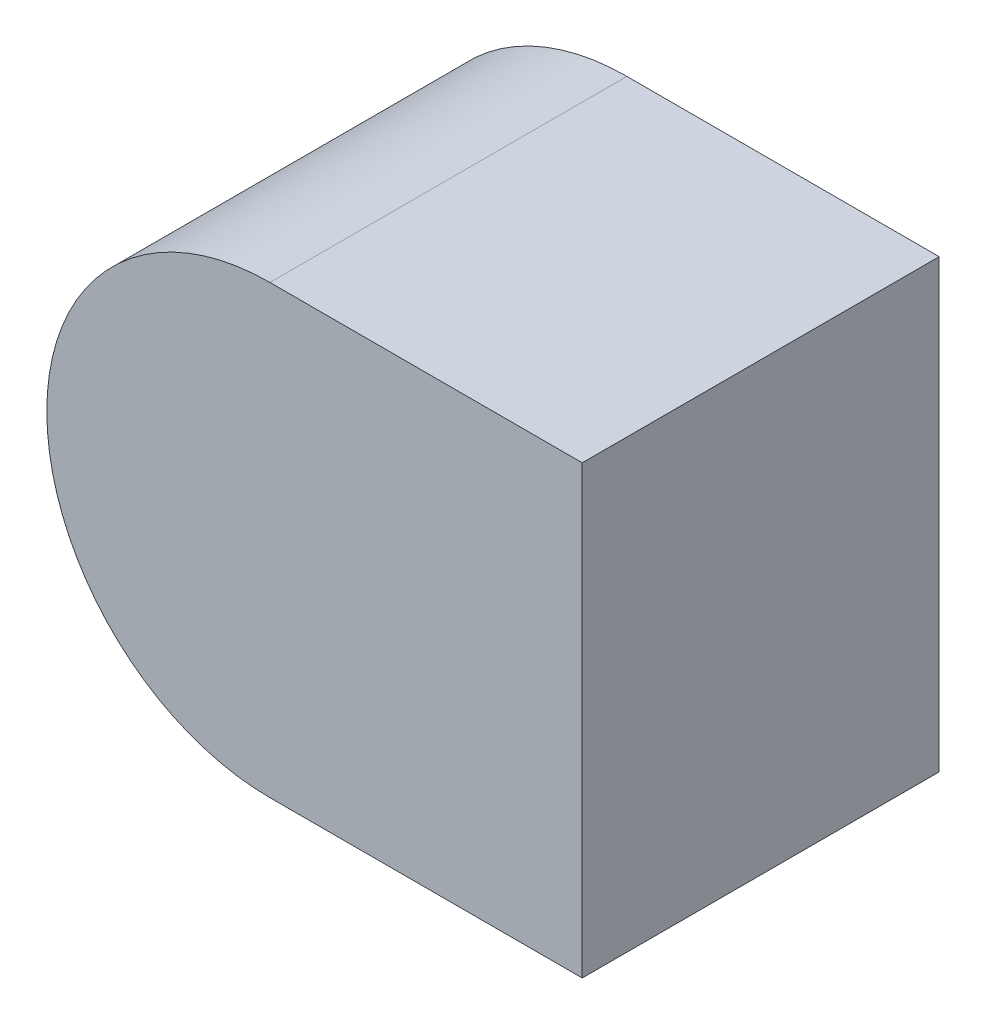
ISO-10303-21;
HEADER;
FILE_DESCRIPTION(('STEP AP214'),'2;1');
FILE_NAME('part.step','',(''),(''),'','','');
FILE_SCHEMA(('AUTOMOTIVE_DESIGN { 1 0 10303 214 1 1 1 1 }'));
ENDSEC;
DATA;
#1=APPLICATION_CONTEXT('core data for automotive mechanical design processes');
#2=APPLICATION_PROTOCOL_DEFINITION('international standard','automotive_design',2000,#1);
#3=PRODUCT_CONTEXT('',#1,'mechanical');
#4=PRODUCT('Part','Part','',(#3));
#5=PRODUCT_RELATED_PRODUCT_CATEGORY('part','',(#4));
#6=PRODUCT_DEFINITION_FORMATION('','',#4);
#7=PRODUCT_DEFINITION_CONTEXT('part definition',#1,'design');
#8=PRODUCT_DEFINITION('design','',#6,#7);
#9=PRODUCT_DEFINITION_SHAPE('','',#8);
#10=(LENGTH_UNIT() NAMED_UNIT(*) SI_UNIT(.MILLI.,.METRE.));
#11=(NAMED_UNIT(*) PLANE_ANGLE_UNIT() SI_UNIT($,.RADIAN.));
#12=(NAMED_UNIT(*) SI_UNIT($,.STERADIAN.) SOLID_ANGLE_UNIT());
#13=UNCERTAINTY_MEASURE_WITH_UNIT(LENGTH_MEASURE(1.E-05),#10,'distance_accuracy_value','');
#14=(GEOMETRIC_REPRESENTATION_CONTEXT(3) GLOBAL_UNCERTAINTY_ASSIGNED_CONTEXT((#13)) GLOBAL_UNIT_ASSIGNED_CONTEXT((#10,
#11,#12)) REPRESENTATION_CONTEXT('',''));
#15=CARTESIAN_POINT('',(0.,0.,0.));
#16=DIRECTION('',(0.,0.,1.));
#17=DIRECTION('',(1.,0.,0.));
#18=AXIS2_PLACEMENT_3D('',#15,#16,#17);
#19=CARTESIAN_POINT('',(0.703,0.375,0.));
#20=DIRECTION('',(0.,-1.,0.));
#21=DIRECTION('',(1.,0.,0.));
#22=AXIS2_PLACEMENT_3D('',#19,#20,#21);
#23=PLANE('',#22);
#24=DIRECTION('',(0.,0.,1.));
#25=VECTOR('',#24,1.);
#26=CARTESIAN_POINT('',(0.828,0.375,0.));
#27=LINE('',#26,#25);
#28=CARTESIAN_POINT('',(0.828,0.375,0.));
#29=VERTEX_POINT('',#28);
#30=CARTESIAN_POINT('',(0.828,0.375,0.2));
#31=VERTEX_POINT('',#30);
#32=EDGE_CURVE('E11',#29,#31,#27,.T.);
#33=ORIENTED_EDGE('',*,*,#32,.T.);
#34=DIRECTION('',(1.,0.,0.));
#35=VECTOR('',#34,1.);
#36=CARTESIAN_POINT('',(0.703,0.375,0.2));
#37=LINE('',#36,#35);
#38=CARTESIAN_POINT('',(1.003,0.375,0.2));
#39=VERTEX_POINT('',#38);
#40=EDGE_CURVE('E24',#31,#39,#37,.T.);
#41=ORIENTED_EDGE('',*,*,#40,.T.);
#42=DIRECTION('',(0.,0.,1.));
#43=VECTOR('',#42,1.);
#44=CARTESIAN_POINT('',(1.003,0.375,0.));
#45=LINE('',#44,#43);
#46=CARTESIAN_POINT('',(1.003,0.375,0.));
#47=VERTEX_POINT('',#46);
#48=EDGE_CURVE('E75',#47,#39,#45,.T.);
#49=ORIENTED_EDGE('',*,*,#48,.F.);
#50=DIRECTION('',(1.,0.,0.));
#51=VECTOR('',#50,1.);
#52=CARTESIAN_POINT('',(0.703,0.375,0.));
#53=LINE('',#52,#51);
#54=EDGE_CURVE('E86',#29,#47,#53,.T.);
#55=ORIENTED_EDGE('',*,*,#54,.F.);
#56=EDGE_LOOP('',(#33,#41,#49,#55));
#57=FACE_BOUND('',#56,.T.);
#58=ADVANCED_FACE('F17',(#57),#23,.F.);
#59=CARTESIAN_POINT('',(0.853,0.25,0.));
#60=DIRECTION('',(0.,0.,-1.));
#61=DIRECTION('',(-1.,0.,0.));
#62=AXIS2_PLACEMENT_3D('',#59,#60,#61);
#63=PLANE('',#62);
#64=CARTESIAN_POINT('',(0.828,0.25,0.));
#65=DIRECTION('',(0.,0.,-1.));
#66=DIRECTION('',(-0.707106781186548,0.707106781186547,0.));
#67=AXIS2_PLACEMENT_3D('',#64,#65,#66);
#68=CIRCLE('',#67,0.125);
#69=CARTESIAN_POINT('',(0.828,0.125,0.));
#70=VERTEX_POINT('',#69);
#71=EDGE_CURVE('E83',#70,#29,#68,.T.);
#72=ORIENTED_EDGE('',*,*,#71,.T.);
#73=ORIENTED_EDGE('',*,*,#54,.T.);
#74=DIRECTION('',(0.,-1.,0.));
#75=VECTOR('',#74,1.);
#76=CARTESIAN_POINT('',(1.003,0.375,0.));
#77=LINE('',#76,#75);
#78=CARTESIAN_POINT('',(1.003,0.125,0.));
#79=VERTEX_POINT('',#78);
#80=EDGE_CURVE('E81',#47,#79,#77,.T.);
#81=ORIENTED_EDGE('',*,*,#80,.T.);
#82=DIRECTION('',(-1.,0.,0.));
#83=VECTOR('',#82,1.);
#84=CARTESIAN_POINT('',(1.003,0.125,0.));
#85=LINE('',#84,#83);
#86=EDGE_CURVE('E60',#79,#70,#85,.T.);
#87=ORIENTED_EDGE('',*,*,#86,.T.);
#88=EDGE_LOOP('',(#72,#73,#81,#87));
#89=FACE_BOUND('',#88,.T.);
#90=ADVANCED_FACE('F91',(#89),#63,.T.);
#91=CARTESIAN_POINT('',(0.828,0.25,0.));
#92=DIRECTION('',(0.,0.,-1.));
#93=DIRECTION('',(-0.707106781186547,-0.707106781186548,0.));
#94=AXIS2_PLACEMENT_3D('',#91,#92,#93);
#95=CYLINDRICAL_SURFACE('',#94,0.125);
#96=CARTESIAN_POINT('',(0.828,0.25,0.2));
#97=DIRECTION('',(0.,0.,1.));
#98=DIRECTION('',(-0.707106781186548,0.707106781186547,0.));
#99=AXIS2_PLACEMENT_3D('',#96,#97,#98);
#100=CIRCLE('',#99,0.125);
#101=CARTESIAN_POINT('',(0.828,0.125,0.2));
#102=VERTEX_POINT('',#101);
#103=EDGE_CURVE('E70',#31,#102,#100,.T.);
#104=ORIENTED_EDGE('',*,*,#103,.F.);
#105=ORIENTED_EDGE('',*,*,#32,.F.);
#106=ORIENTED_EDGE('',*,*,#71,.F.);
#107=DIRECTION('',(0.,0.,-1.));
#108=VECTOR('',#107,1.);
#109=CARTESIAN_POINT('',(0.828,0.125,0.));
#110=LINE('',#109,#108);
#111=EDGE_CURVE('E64',#102,#70,#110,.T.);
#112=ORIENTED_EDGE('',*,*,#111,.F.);
#113=EDGE_LOOP('',(#104,#105,#106,#112));
#114=FACE_BOUND('',#113,.T.);
#115=ADVANCED_FACE('F89',(#114),#95,.T.);
#116=CARTESIAN_POINT('',(1.003,0.125,0.));
#117=DIRECTION('',(0.,1.,0.));
#118=DIRECTION('',(-1.,0.,0.));
#119=AXIS2_PLACEMENT_3D('',#116,#117,#118);
#120=PLANE('',#119);
#121=ORIENTED_EDGE('',*,*,#111,.T.);
#122=ORIENTED_EDGE('',*,*,#86,.F.);
#123=DIRECTION('',(0.,0.,1.));
#124=VECTOR('',#123,1.);
#125=CARTESIAN_POINT('',(1.003,0.125,0.));
#126=LINE('',#125,#124);
#127=CARTESIAN_POINT('',(1.003,0.125,0.2));
#128=VERTEX_POINT('',#127);
#129=EDGE_CURVE('E54',#79,#128,#126,.T.);
#130=ORIENTED_EDGE('',*,*,#129,.T.);
#131=DIRECTION('',(-1.,0.,0.));
#132=VECTOR('',#131,1.);
#133=CARTESIAN_POINT('',(1.003,0.125,0.2));
#134=LINE('',#133,#132);
#135=EDGE_CURVE('E58',#128,#102,#134,.T.);
#136=ORIENTED_EDGE('',*,*,#135,.T.);
#137=EDGE_LOOP('',(#121,#122,#130,#136));
#138=FACE_BOUND('',#137,.T.);
#139=ADVANCED_FACE('F57',(#138),#120,.F.);
#140=CARTESIAN_POINT('',(1.003,0.375,0.));
#141=DIRECTION('',(-1.,0.,0.));
#142=DIRECTION('',(0.,-1.,0.));
#143=AXIS2_PLACEMENT_3D('',#140,#141,#142);
#144=PLANE('',#143);
#145=ORIENTED_EDGE('',*,*,#80,.F.);
#146=ORIENTED_EDGE('',*,*,#48,.T.);
#147=DIRECTION('',(0.,-1.,0.));
#148=VECTOR('',#147,1.);
#149=CARTESIAN_POINT('',(1.003,0.375,0.2));
#150=LINE('',#149,#148);
#151=EDGE_CURVE('E69',#39,#128,#150,.T.);
#152=ORIENTED_EDGE('',*,*,#151,.T.);
#153=ORIENTED_EDGE('',*,*,#129,.F.);
#154=EDGE_LOOP('',(#145,#146,#152,#153));
#155=FACE_BOUND('',#154,.T.);
#156=ADVANCED_FACE('F74',(#155),#144,.F.);
#157=CARTESIAN_POINT('',(0.853,0.25,0.2));
#158=DIRECTION('',(0.,0.,-1.));
#159=DIRECTION('',(-1.,0.,0.));
#160=AXIS2_PLACEMENT_3D('',#157,#158,#159);
#161=PLANE('',#160);
#162=ORIENTED_EDGE('',*,*,#103,.T.);
#163=ORIENTED_EDGE('',*,*,#135,.F.);
#164=ORIENTED_EDGE('',*,*,#151,.F.);
#165=ORIENTED_EDGE('',*,*,#40,.F.);
#166=EDGE_LOOP('',(#162,#163,#164,#165));
#167=FACE_BOUND('',#166,.T.);
#168=ADVANCED_FACE('F68',(#167),#161,.F.);
#169=CLOSED_SHELL('',(#58,#90,#115,#139,#156,#168));
#170=MANIFOLD_SOLID_BREP('B1',#169);
#171=ADVANCED_BREP_SHAPE_REPRESENTATION('',(#18,#170),#14);
#172=SHAPE_DEFINITION_REPRESENTATION(#9,#171);
ENDSEC;
END-ISO-10303-21;
